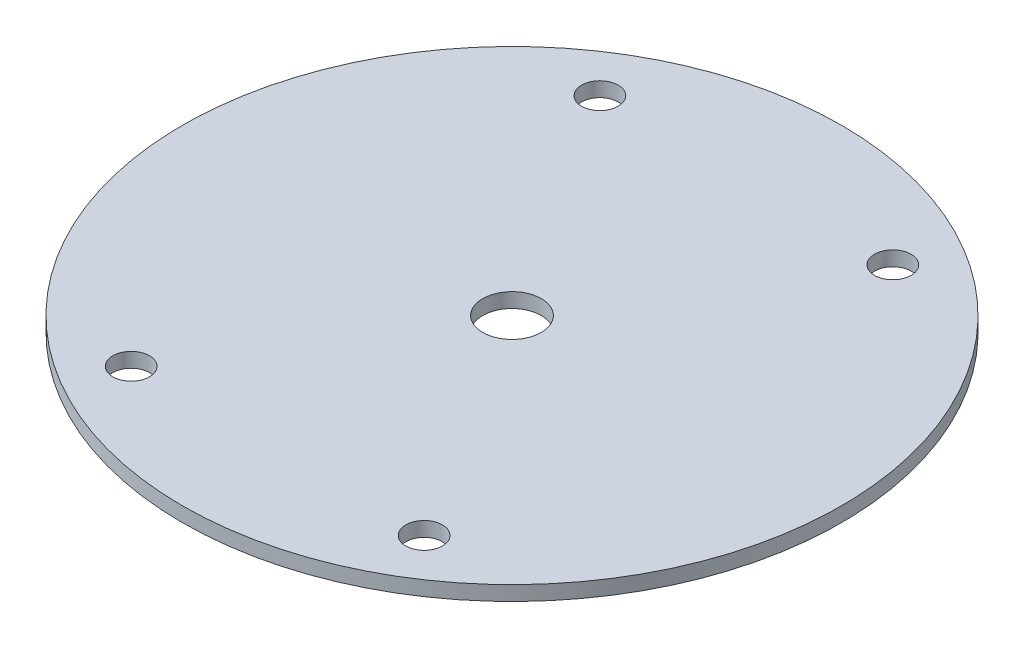
ISO-10303-21;
HEADER;
FILE_DESCRIPTION(('STEP AP214'),'2;1');
FILE_NAME('part.step','',(''),(''),'','','');
FILE_SCHEMA(('AUTOMOTIVE_DESIGN { 1 0 10303 214 1 1 1 1 }'));
ENDSEC;
DATA;
#1=APPLICATION_CONTEXT('core data for automotive mechanical design processes');
#2=APPLICATION_PROTOCOL_DEFINITION('international standard','automotive_design',2000,#1);
#3=PRODUCT_CONTEXT('',#1,'mechanical');
#4=PRODUCT('Part','Part','',(#3));
#5=PRODUCT_RELATED_PRODUCT_CATEGORY('part','',(#4));
#6=PRODUCT_DEFINITION_FORMATION('','',#4);
#7=PRODUCT_DEFINITION_CONTEXT('part definition',#1,'design');
#8=PRODUCT_DEFINITION('design','',#6,#7);
#9=PRODUCT_DEFINITION_SHAPE('','',#8);
#10=(LENGTH_UNIT() NAMED_UNIT(*) SI_UNIT(.MILLI.,.METRE.));
#11=(NAMED_UNIT(*) PLANE_ANGLE_UNIT() SI_UNIT($,.RADIAN.));
#12=(NAMED_UNIT(*) SI_UNIT($,.STERADIAN.) SOLID_ANGLE_UNIT());
#13=UNCERTAINTY_MEASURE_WITH_UNIT(LENGTH_MEASURE(1.E-05),#10,'distance_accuracy_value','');
#14=(GEOMETRIC_REPRESENTATION_CONTEXT(3) GLOBAL_UNCERTAINTY_ASSIGNED_CONTEXT((#13)) GLOBAL_UNIT_ASSIGNED_CONTEXT((#10,
#11,#12)) REPRESENTATION_CONTEXT('',''));
#15=CARTESIAN_POINT('',(0.,0.,0.));
#16=DIRECTION('',(0.,0.,1.));
#17=DIRECTION('',(1.,0.,0.));
#18=AXIS2_PLACEMENT_3D('',#15,#16,#17);
#19=CARTESIAN_POINT('',(0.,2.,0.));
#20=DIRECTION('',(0.,1.,0.));
#21=DIRECTION('',(0.,0.,1.));
#22=AXIS2_PLACEMENT_3D('',#19,#20,#21);
#23=PLANE('',#22);
#24=CARTESIAN_POINT('',(-20.,2.,32.));
#25=DIRECTION('',(0.,1.,0.));
#26=DIRECTION('',(0.,0.,1.));
#27=AXIS2_PLACEMENT_3D('',#24,#25,#26);
#28=CIRCLE('',#27,2.5);
#29=CARTESIAN_POINT('',(-20.,2.,34.5));
#30=VERTEX_POINT('',#29);
#31=EDGE_CURVE('E61',#30,#30,#28,.T.);
#32=ORIENTED_EDGE('',*,*,#31,.F.);
#33=EDGE_LOOP('',(#32));
#34=FACE_BOUND('',#33,.T.);
#35=CARTESIAN_POINT('',(20.,2.,-32.));
#36=DIRECTION('',(0.,1.,0.));
#37=DIRECTION('',(0.,0.,1.));
#38=AXIS2_PLACEMENT_3D('',#35,#36,#37);
#39=CIRCLE('',#38,2.5);
#40=CARTESIAN_POINT('',(20.,2.,-29.5));
#41=VERTEX_POINT('',#40);
#42=EDGE_CURVE('E49',#41,#41,#39,.T.);
#43=ORIENTED_EDGE('',*,*,#42,.F.);
#44=EDGE_LOOP('',(#43));
#45=FACE_BOUND('',#44,.T.);
#46=CARTESIAN_POINT('',(0.,2.,0.));
#47=DIRECTION('',(0.,1.,0.));
#48=DIRECTION('',(0.,0.,1.));
#49=AXIS2_PLACEMENT_3D('',#46,#47,#48);
#50=CIRCLE('',#49,45.);
#51=CARTESIAN_POINT('',(0.,2.,45.));
#52=VERTEX_POINT('',#51);
#53=EDGE_CURVE('E10',#52,#52,#50,.T.);
#54=ORIENTED_EDGE('',*,*,#53,.T.);
#55=EDGE_LOOP('',(#54));
#56=FACE_BOUND('',#55,.T.);
#57=CARTESIAN_POINT('',(-20.,2.,-32.));
#58=DIRECTION('',(0.,1.,0.));
#59=DIRECTION('',(0.,0.,1.));
#60=AXIS2_PLACEMENT_3D('',#57,#58,#59);
#61=CIRCLE('',#60,2.5);
#62=CARTESIAN_POINT('',(-20.,2.,-29.5));
#63=VERTEX_POINT('',#62);
#64=EDGE_CURVE('E44',#63,#63,#61,.T.);
#65=ORIENTED_EDGE('',*,*,#64,.F.);
#66=EDGE_LOOP('',(#65));
#67=FACE_BOUND('',#66,.T.);
#68=CARTESIAN_POINT('',(20.,2.,32.));
#69=DIRECTION('',(0.,1.,0.));
#70=DIRECTION('',(0.,0.,1.));
#71=AXIS2_PLACEMENT_3D('',#68,#69,#70);
#72=CIRCLE('',#71,2.5);
#73=CARTESIAN_POINT('',(20.,2.,34.5));
#74=VERTEX_POINT('',#73);
#75=EDGE_CURVE('E55',#74,#74,#72,.T.);
#76=ORIENTED_EDGE('',*,*,#75,.F.);
#77=EDGE_LOOP('',(#76));
#78=FACE_BOUND('',#77,.T.);
#79=CARTESIAN_POINT('',(0.,2.,0.));
#80=DIRECTION('',(0.,1.,0.));
#81=DIRECTION('',(0.,0.,1.));
#82=AXIS2_PLACEMENT_3D('',#79,#80,#81);
#83=CIRCLE('',#82,4.);
#84=CARTESIAN_POINT('',(0.,2.,4.));
#85=VERTEX_POINT('',#84);
#86=EDGE_CURVE('E67',#85,#85,#83,.T.);
#87=ORIENTED_EDGE('',*,*,#86,.F.);
#88=EDGE_LOOP('',(#87));
#89=FACE_BOUND('',#88,.T.);
#90=ADVANCED_FACE('F33',(#34,#45,#56,#67,#78,#89),#23,.T.);
#91=CARTESIAN_POINT('',(0.,0.,0.));
#92=DIRECTION('',(0.,1.,0.));
#93=DIRECTION('',(0.,0.,1.));
#94=AXIS2_PLACEMENT_3D('',#91,#92,#93);
#95=PLANE('',#94);
#96=CARTESIAN_POINT('',(0.,0.,0.));
#97=DIRECTION('',(0.,1.,0.));
#98=DIRECTION('',(0.,0.,1.));
#99=AXIS2_PLACEMENT_3D('',#96,#97,#98);
#100=CIRCLE('',#99,45.);
#101=CARTESIAN_POINT('',(0.,0.,45.));
#102=VERTEX_POINT('',#101);
#103=EDGE_CURVE('E37',#102,#102,#100,.T.);
#104=ORIENTED_EDGE('',*,*,#103,.F.);
#105=EDGE_LOOP('',(#104));
#106=FACE_BOUND('',#105,.T.);
#107=CARTESIAN_POINT('',(-20.,0.,-32.));
#108=DIRECTION('',(0.,1.,0.));
#109=DIRECTION('',(0.,0.,1.));
#110=AXIS2_PLACEMENT_3D('',#107,#108,#109);
#111=CIRCLE('',#110,2.5);
#112=CARTESIAN_POINT('',(-20.,0.,-29.5));
#113=VERTEX_POINT('',#112);
#114=EDGE_CURVE('E46',#113,#113,#111,.T.);
#115=ORIENTED_EDGE('',*,*,#114,.T.);
#116=EDGE_LOOP('',(#115));
#117=FACE_BOUND('',#116,.T.);
#118=CARTESIAN_POINT('',(20.,0.,-32.));
#119=DIRECTION('',(0.,1.,0.));
#120=DIRECTION('',(0.,0.,1.));
#121=AXIS2_PLACEMENT_3D('',#118,#119,#120);
#122=CIRCLE('',#121,2.5);
#123=CARTESIAN_POINT('',(20.,0.,-29.5));
#124=VERTEX_POINT('',#123);
#125=EDGE_CURVE('E52',#124,#124,#122,.T.);
#126=ORIENTED_EDGE('',*,*,#125,.T.);
#127=EDGE_LOOP('',(#126));
#128=FACE_BOUND('',#127,.T.);
#129=CARTESIAN_POINT('',(20.,0.,32.));
#130=DIRECTION('',(0.,1.,0.));
#131=DIRECTION('',(0.,0.,1.));
#132=AXIS2_PLACEMENT_3D('',#129,#130,#131);
#133=CIRCLE('',#132,2.5);
#134=CARTESIAN_POINT('',(20.,0.,34.5));
#135=VERTEX_POINT('',#134);
#136=EDGE_CURVE('E58',#135,#135,#133,.T.);
#137=ORIENTED_EDGE('',*,*,#136,.T.);
#138=EDGE_LOOP('',(#137));
#139=FACE_BOUND('',#138,.T.);
#140=CARTESIAN_POINT('',(-20.,0.,32.));
#141=DIRECTION('',(0.,1.,0.));
#142=DIRECTION('',(0.,0.,1.));
#143=AXIS2_PLACEMENT_3D('',#140,#141,#142);
#144=CIRCLE('',#143,2.5);
#145=CARTESIAN_POINT('',(-20.,0.,34.5));
#146=VERTEX_POINT('',#145);
#147=EDGE_CURVE('E64',#146,#146,#144,.T.);
#148=ORIENTED_EDGE('',*,*,#147,.T.);
#149=EDGE_LOOP('',(#148));
#150=FACE_BOUND('',#149,.T.);
#151=CARTESIAN_POINT('',(0.,0.,0.));
#152=DIRECTION('',(0.,1.,0.));
#153=DIRECTION('',(0.,0.,1.));
#154=AXIS2_PLACEMENT_3D('',#151,#152,#153);
#155=CIRCLE('',#154,4.);
#156=CARTESIAN_POINT('',(0.,0.,4.));
#157=VERTEX_POINT('',#156);
#158=EDGE_CURVE('E70',#157,#157,#155,.T.);
#159=ORIENTED_EDGE('',*,*,#158,.T.);
#160=EDGE_LOOP('',(#159));
#161=FACE_BOUND('',#160,.T.);
#162=ADVANCED_FACE('F80',(#106,#117,#128,#139,#150,#161),#95,.F.);
#163=CARTESIAN_POINT('',(0.,2.,0.));
#164=DIRECTION('',(0.,-1.,0.));
#165=DIRECTION('',(0.,0.,-1.));
#166=AXIS2_PLACEMENT_3D('',#163,#164,#165);
#167=CYLINDRICAL_SURFACE('',#166,45.);
#168=ORIENTED_EDGE('',*,*,#53,.F.);
#169=EDGE_LOOP('',(#168));
#170=FACE_BOUND('',#169,.T.);
#171=ORIENTED_EDGE('',*,*,#103,.T.);
#172=EDGE_LOOP('',(#171));
#173=FACE_BOUND('',#172,.T.);
#174=ADVANCED_FACE('F35',(#170,#173),#167,.T.);
#175=CARTESIAN_POINT('',(-20.,2.,-32.));
#176=DIRECTION('',(0.,-1.,0.));
#177=DIRECTION('',(0.,0.,-1.));
#178=AXIS2_PLACEMENT_3D('',#175,#176,#177);
#179=CYLINDRICAL_SURFACE('',#178,2.5);
#180=ORIENTED_EDGE('',*,*,#64,.T.);
#181=EDGE_LOOP('',(#180));
#182=FACE_BOUND('',#181,.T.);
#183=ORIENTED_EDGE('',*,*,#114,.F.);
#184=EDGE_LOOP('',(#183));
#185=FACE_BOUND('',#184,.T.);
#186=ADVANCED_FACE('F90',(#182,#185),#179,.F.);
#187=CARTESIAN_POINT('',(20.,2.,-32.));
#188=DIRECTION('',(0.,-1.,0.));
#189=DIRECTION('',(0.,0.,-1.));
#190=AXIS2_PLACEMENT_3D('',#187,#188,#189);
#191=CYLINDRICAL_SURFACE('',#190,2.5);
#192=ORIENTED_EDGE('',*,*,#42,.T.);
#193=EDGE_LOOP('',(#192));
#194=FACE_BOUND('',#193,.T.);
#195=ORIENTED_EDGE('',*,*,#125,.F.);
#196=EDGE_LOOP('',(#195));
#197=FACE_BOUND('',#196,.T.);
#198=ADVANCED_FACE('F93',(#194,#197),#191,.F.);
#199=CARTESIAN_POINT('',(20.,2.,32.));
#200=DIRECTION('',(0.,-1.,0.));
#201=DIRECTION('',(0.,0.,-1.));
#202=AXIS2_PLACEMENT_3D('',#199,#200,#201);
#203=CYLINDRICAL_SURFACE('',#202,2.5);
#204=ORIENTED_EDGE('',*,*,#75,.T.);
#205=EDGE_LOOP('',(#204));
#206=FACE_BOUND('',#205,.T.);
#207=ORIENTED_EDGE('',*,*,#136,.F.);
#208=EDGE_LOOP('',(#207));
#209=FACE_BOUND('',#208,.T.);
#210=ADVANCED_FACE('F97',(#206,#209),#203,.F.);
#211=CARTESIAN_POINT('',(-20.,2.,32.));
#212=DIRECTION('',(0.,-1.,0.));
#213=DIRECTION('',(0.,0.,-1.));
#214=AXIS2_PLACEMENT_3D('',#211,#212,#213);
#215=CYLINDRICAL_SURFACE('',#214,2.5);
#216=ORIENTED_EDGE('',*,*,#31,.T.);
#217=EDGE_LOOP('',(#216));
#218=FACE_BOUND('',#217,.T.);
#219=ORIENTED_EDGE('',*,*,#147,.F.);
#220=EDGE_LOOP('',(#219));
#221=FACE_BOUND('',#220,.T.);
#222=ADVANCED_FACE('F101',(#218,#221),#215,.F.);
#223=CARTESIAN_POINT('',(0.,2.,0.));
#224=DIRECTION('',(0.,-1.,0.));
#225=DIRECTION('',(0.,0.,-1.));
#226=AXIS2_PLACEMENT_3D('',#223,#224,#225);
#227=CYLINDRICAL_SURFACE('',#226,4.);
#228=ORIENTED_EDGE('',*,*,#86,.T.);
#229=EDGE_LOOP('',(#228));
#230=FACE_BOUND('',#229,.T.);
#231=ORIENTED_EDGE('',*,*,#158,.F.);
#232=EDGE_LOOP('',(#231));
#233=FACE_BOUND('',#232,.T.);
#234=ADVANCED_FACE('F76',(#230,#233),#227,.F.);
#235=CLOSED_SHELL('',(#90,#162,#174,#186,#198,#210,#222,#234));
#236=MANIFOLD_SOLID_BREP('B2',#235);
#237=ADVANCED_BREP_SHAPE_REPRESENTATION('',(#18,#236),#14);
#238=SHAPE_DEFINITION_REPRESENTATION(#9,#237);
ENDSEC;
END-ISO-10303-21;
